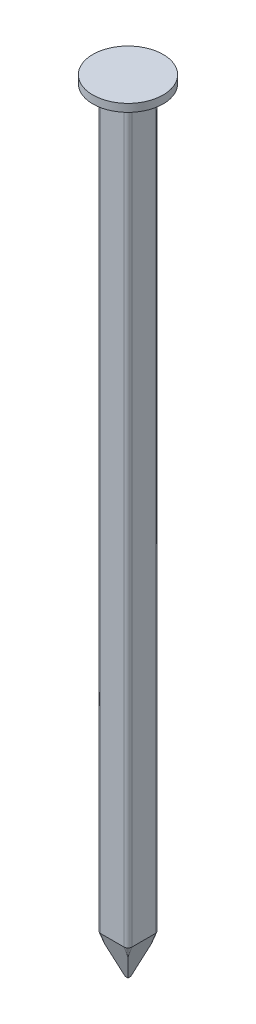
ISO-10303-21;
HEADER;
FILE_DESCRIPTION(('STEP AP214'),'2;1');
FILE_NAME('part.step','',(''),(''),'','','');
FILE_SCHEMA(('AUTOMOTIVE_DESIGN { 1 0 10303 214 1 1 1 1 }'));
ENDSEC;
DATA;
#1=APPLICATION_CONTEXT('core data for automotive mechanical design processes');
#2=APPLICATION_PROTOCOL_DEFINITION('international standard','automotive_design',2000,#1);
#3=PRODUCT_CONTEXT('',#1,'mechanical');
#4=PRODUCT('Part','Part','',(#3));
#5=PRODUCT_RELATED_PRODUCT_CATEGORY('part','',(#4));
#6=PRODUCT_DEFINITION_FORMATION('','',#4);
#7=PRODUCT_DEFINITION_CONTEXT('part definition',#1,'design');
#8=PRODUCT_DEFINITION('design','',#6,#7);
#9=PRODUCT_DEFINITION_SHAPE('','',#8);
#10=(LENGTH_UNIT() NAMED_UNIT(*) SI_UNIT(.MILLI.,.METRE.));
#11=(NAMED_UNIT(*) PLANE_ANGLE_UNIT() SI_UNIT($,.RADIAN.));
#12=(NAMED_UNIT(*) SI_UNIT($,.STERADIAN.) SOLID_ANGLE_UNIT());
#13=UNCERTAINTY_MEASURE_WITH_UNIT(LENGTH_MEASURE(1.E-05),#10,'distance_accuracy_value','');
#14=(GEOMETRIC_REPRESENTATION_CONTEXT(3) GLOBAL_UNCERTAINTY_ASSIGNED_CONTEXT((#13)) GLOBAL_UNIT_ASSIGNED_CONTEXT((#10,
#11,#12)) REPRESENTATION_CONTEXT('',''));
#15=CARTESIAN_POINT('',(0.,0.,0.));
#16=DIRECTION('',(0.,0.,1.));
#17=DIRECTION('',(1.,0.,0.));
#18=AXIS2_PLACEMENT_3D('',#15,#16,#17);
#19=CARTESIAN_POINT('',(-1.5,-95.,-1.5));
#20=DIRECTION('',(0.,1.,0.));
#21=DIRECTION('',(0.,0.,1.));
#22=AXIS2_PLACEMENT_3D('',#19,#20,#21);
#23=CYLINDRICAL_SURFACE('',#22,0.5);
#24=DIRECTION('',(0.,1.,0.));
#25=VECTOR('',#24,1.);
#26=CARTESIAN_POINT('',(-2.,-95.,-1.5));
#27=LINE('',#26,#25);
#28=CARTESIAN_POINT('',(-2.,-95.,-1.5));
#29=VERTEX_POINT('',#28);
#30=CARTESIAN_POINT('',(-2.,-2.15470053837925,-1.5));
#31=VERTEX_POINT('',#30);
#32=EDGE_CURVE('E37',#29,#31,#27,.T.);
#33=ORIENTED_EDGE('',*,*,#32,.T.);
#34=CARTESIAN_POINT('',(-1.99999996,-2.15476983593147,-1.4998));
#35=CARTESIAN_POINT('',(-2.00003684014058,-2.14575618471847,-1.525783701334));
#36=CARTESIAN_POINT('',(-1.99799540762178,-2.13744964998378,-1.55204559931092));
#37=CARTESIAN_POINT('',(-1.98968885677274,-2.1224428889359,-1.60441452090182));
#38=CARTESIAN_POINT('',(-1.98341509120903,-2.11574598939564,-1.63052111682859));
#39=CARTESIAN_POINT('',(-1.96655431052977,-2.10417422989742,-1.68182187885693));
#40=CARTESIAN_POINT('',(-1.95595614217757,-2.0993041443578,-1.70701350076372));
#41=CARTESIAN_POINT('',(-1.93063714242362,-2.0915829700223,-1.7555363353753));
#42=CARTESIAN_POINT('',(-1.91592151459877,-2.08872934879656,-1.77886984882169));
#43=CARTESIAN_POINT('',(-1.88358830025173,-2.08522815054813,-1.82178474147054));
#44=CARTESIAN_POINT('',(-1.86615388424268,-2.08447684250158,-1.84149580755948));
#45=CARTESIAN_POINT('',(-1.82842003165084,-2.08490769013287,-1.87792554006889));
#46=CARTESIAN_POINT('',(-1.80812092834765,-2.08608962106558,-1.89464455407418));
#47=CARTESIAN_POINT('',(-1.76588473919362,-2.09028666079645,-1.9242070774973));
#48=CARTESIAN_POINT('',(-1.74400805445983,-2.09325045964667,-1.93714452533199));
#49=CARTESIAN_POINT('',(-1.69877629962379,-2.10087626098998,-1.95948361219108));
#50=CARTESIAN_POINT('',(-1.67542001374561,-2.10553967539711,-1.96888229823954));
#51=CARTESIAN_POINT('',(-1.62674800369761,-2.11669609986594,-1.98437309599953));
#52=CARTESIAN_POINT('',(-1.60139225805675,-2.12326719153514,-1.99028176251223));
#53=CARTESIAN_POINT('',(-1.55053657305396,-2.13792801623413,-1.99810966579598));
#54=CARTESIAN_POINT('',(-1.52503686111886,-2.14601578498056,-2.0000340243494));
#55=CARTESIAN_POINT('',(-1.4998,-2.15476983593147,-1.99999996));
#56=B_SPLINE_CURVE_WITH_KNOTS('',3,(#34,#35,#36,#37,#38,#39,#40,#41,#42,#43,#44,#45,#46,#47,#48,
#49,#50,#51,#52,#53,#54,#55),.UNSPECIFIED.,.F.,.F.,(4,2,2,2,2,2,2,2,2,2,4),(0.,
0.0824667533171372,0.165102509809409,0.247952756315008,0.330698767336507,0.409283218051729,
0.487858533725675,0.564272874172714,0.640750839197006,0.720955531812514,0.801057058036558),.UNSPECIFIED.);
#57=CARTESIAN_POINT('',(-1.5,-2.15470053837925,-2.));
#58=VERTEX_POINT('',#57);
#59=EDGE_CURVE('E50',#31,#58,#56,.T.);
#60=ORIENTED_EDGE('',*,*,#59,.T.);
#61=DIRECTION('',(0.,1.,0.));
#62=VECTOR('',#61,1.);
#63=CARTESIAN_POINT('',(-1.5,-95.,-2.));
#64=LINE('',#63,#62);
#65=CARTESIAN_POINT('',(-1.5,-95.,-2.));
#66=VERTEX_POINT('',#65);
#67=EDGE_CURVE('E11',#66,#58,#64,.T.);
#68=ORIENTED_EDGE('',*,*,#67,.F.);
#69=CARTESIAN_POINT('',(-1.5,-95.,-1.5));
#70=DIRECTION('',(0.,1.,0.));
#71=DIRECTION('',(0.,0.,1.));
#72=AXIS2_PLACEMENT_3D('',#69,#70,#71);
#73=CIRCLE('',#72,0.5);
#74=EDGE_CURVE('E139',#66,#29,#73,.T.);
#75=ORIENTED_EDGE('',*,*,#74,.T.);
#76=EDGE_LOOP('',(#33,#60,#68,#75));
#77=FACE_BOUND('',#76,.T.);
#78=ADVANCED_FACE('F33',(#77),#23,.T.);
#79=CARTESIAN_POINT('',(-1.5,-95.,-2.));
#80=DIRECTION('',(0.,0.,-1.));
#81=DIRECTION('',(-1.,0.,0.));
#82=AXIS2_PLACEMENT_3D('',#79,#80,#81);
#83=PLANE('',#82);
#84=ORIENTED_EDGE('',*,*,#67,.T.);
#85=CARTESIAN_POINT('',(-3.28477697833419,-1.37773391061121,-2.));
#86=CARTESIAN_POINT('',(-3.1957489554578,-1.42162615000085,-2.));
#87=CARTESIAN_POINT('',(-3.1065352416587,-1.4651473830419,-2.));
#88=CARTESIAN_POINT('',(-2.92763830688956,-1.55124227115972,-2.));
#89=CARTESIAN_POINT('',(-2.8379550279747,-1.59381580571476,-2.));
#90=CARTESIAN_POINT('',(-2.65764119106146,-1.67798623291829,-2.));
#91=CARTESIAN_POINT('',(-2.56700819065231,-1.71957790907827,-2.));
#92=CARTESIAN_POINT('',(-2.3850827442105,-1.8012874669202,-2.));
#93=CARTESIAN_POINT('',(-2.29379032491544,-1.84140540796105,-2.));
#94=CARTESIAN_POINT('',(-2.10678906994039,-1.92132826897922,-2.));
#95=CARTESIAN_POINT('',(-2.01104810592664,-1.96105837882354,-2.));
#96=CARTESIAN_POINT('',(-1.8185319980613,-2.0379242656392,-2.));
#97=CARTESIAN_POINT('',(-1.72175693185083,-2.0750602358242,-2.));
#98=CARTESIAN_POINT('',(-1.5271219449094,-2.14590513694263,-2.));
#99=CARTESIAN_POINT('',(-1.42926397122525,-2.17961936938412,-2.));
#100=CARTESIAN_POINT('',(-1.23215592049787,-2.24265755514095,-2.));
#101=CARTESIAN_POINT('',(-1.13290623457587,-2.27198271593115,-2.));
#102=CARTESIAN_POINT('',(-0.933597053993751,-2.32478289951834,-2.));
#103=CARTESIAN_POINT('',(-0.833548434895385,-2.34829827972771,-2.));
#104=CARTESIAN_POINT('',(-0.632040787543292,-2.38831815959652,-2.));
#105=CARTESIAN_POINT('',(-0.530581961535164,-2.40482365408402,-2.));
#106=CARTESIAN_POINT('',(-0.328079247272528,-2.42931716075328,-2.));
#107=CARTESIAN_POINT('',(-0.227050020666948,-2.43742310448378,-2.));
#108=CARTESIAN_POINT('',(-0.0246603585570567,-2.4447602810518,-2.));
#109=CARTESIAN_POINT('',(0.07670007969145,-2.44399144017154,-2.));
#110=CARTESIAN_POINT('',(0.287373128420986,-2.43321875082972,-2.));
#111=CARTESIAN_POINT('',(0.39664614513125,-2.4224523080912,-2.));
#112=CARTESIAN_POINT('',(0.613874728342375,-2.39174346657701,-2.));
#113=CARTESIAN_POINT('',(0.721829986913001,-2.37179896369372,-2.));
#114=CARTESIAN_POINT('',(0.938211623678123,-2.32397126492567,-2.));
#115=CARTESIAN_POINT('',(1.04660380722846,-2.29593646846384,-2.));
#116=CARTESIAN_POINT('',(1.20786418144834,-2.24940143123157,-2.));
#117=CARTESIAN_POINT('',(1.26139841861617,-2.23314187827818,-2.));
#118=CARTESIAN_POINT('',(1.36805001858107,-2.19931741851383,-2.));
#119=CARTESIAN_POINT('',(1.42116740748875,-2.18175259419595,-2.));
#120=CARTESIAN_POINT('',(1.60797842683138,-2.1177680482363,-2.));
#121=CARTESIAN_POINT('',(1.74063256902876,-2.06831134429003,-2.));
#122=CARTESIAN_POINT('',(2.00397950927888,-1.96439782633082,-2.));
#123=CARTESIAN_POINT('',(2.13467164233102,-1.90993935964097,-2.));
#124=CARTESIAN_POINT('',(2.39465874617247,-1.7974294270013,-2.));
#125=CARTESIAN_POINT('',(2.52395206134399,-1.73937415604916,-2.));
#126=CARTESIAN_POINT('',(2.78133755448349,-1.62071700955447,-2.));
#127=CARTESIAN_POINT('',(2.90942988308771,-1.56011545875556,-2.));
#128=CARTESIAN_POINT('',(3.16520218523652,-1.43678485954758,-2.));
#129=CARTESIAN_POINT('',(3.29287857652262,-1.37404840548216,-2.));
#130=CARTESIAN_POINT('',(3.54751517855462,-1.2471363770796,-2.));
#131=CARTESIAN_POINT('',(3.67447537537265,-1.1829607748752,-2.));
#132=CARTESIAN_POINT('',(4.05436153839928,-0.988873159587793,-2.));
#133=CARTESIAN_POINT('',(4.30644994561204,-0.857323577105432,-2.));
#134=CARTESIAN_POINT('',(4.77602890920528,-0.609046776623574,-2.));
#135=CARTESIAN_POINT('',(4.99369703537458,-0.492653231139337,-2.));
#136=CARTESIAN_POINT('',(5.42829264550693,-0.25840108257643,-2.));
#137=CARTESIAN_POINT('',(5.6452199926524,-0.140542225737419,-2.));
#138=CARTESIAN_POINT('',(6.07693201068448,0.0953535484512582,-2.));
#139=CARTESIAN_POINT('',(6.29172079694644,0.213382948402986,-2.));
#140=CARTESIAN_POINT('',(6.72082497884446,0.450200576881975,-2.));
#141=CARTESIAN_POINT('',(6.9351404589103,0.568988652358618,-2.));
#142=CARTESIAN_POINT('',(7.14930467910168,0.688047032893749,-2.));
#143=B_SPLINE_CURVE_WITH_KNOTS('',3,(#85,#86,#87,#88,#89,#90,#91,#92,#93,#94,#95,#96,#97,#98,
#99,#100,#101,#102,#103,#104,#105,#106,#107,#108,#109,#110,#111,#112,#113,#114,#115,#116,#117,
#118,#119,#120,#121,#122,#123,#124,#125,#126,#127,#128,#129,#130,#131,#132,#133,#134,#135,#136,
#137,#138,#139,#140,#141,#142),.UNSPECIFIED.,.F.,.F.,(4,2,2,2,2,2,2,2,2,2,2,2,2,2,2,2,2,2,2,2,2,
2,2,2,2,2,2,2,4),(0.,0.297782400908863,0.595602457833325,0.894753823434955,1.19389312662066,
1.50483569396109,1.81575507729584,2.1261851344104,2.4365296316958,2.74465355992285,
3.05273374523402,3.35642726894603,3.6601233152688,3.98907232486469,4.31809678495671,
4.65373881487502,4.82157313735561,4.98939686172237,5.41394714545746,5.8386382167832,
6.26378649834016,6.68888072158565,7.1156405664752,7.54240868216504,8.39542107096749,
9.13591709001367,9.8765431844943,10.6117873881486,11.3468876793801),.UNSPECIFIED.);
#144=CARTESIAN_POINT('',(1.5,-2.15470053837925,-2.));
#145=VERTEX_POINT('',#144);
#146=EDGE_CURVE('E241',#58,#145,#143,.T.);
#147=ORIENTED_EDGE('',*,*,#146,.T.);
#148=DIRECTION('',(0.,1.,0.));
#149=VECTOR('',#148,1.);
#150=CARTESIAN_POINT('',(1.5,-95.,-2.));
#151=LINE('',#150,#149);
#152=CARTESIAN_POINT('',(1.5,-95.,-2.));
#153=VERTEX_POINT('',#152);
#154=EDGE_CURVE('E42',#153,#145,#151,.T.);
#155=ORIENTED_EDGE('',*,*,#154,.F.);
#156=DIRECTION('',(-1.,0.,0.));
#157=VECTOR('',#156,1.);
#158=CARTESIAN_POINT('',(-1.5,-95.,-2.));
#159=LINE('',#158,#157);
#160=EDGE_CURVE('E130',#153,#66,#159,.T.);
#161=ORIENTED_EDGE('',*,*,#160,.T.);
#162=EDGE_LOOP('',(#84,#147,#155,#161));
#163=FACE_BOUND('',#162,.T.);
#164=ADVANCED_FACE('F151',(#163),#83,.T.);
#165=CARTESIAN_POINT('',(1.5,-95.,-1.5));
#166=DIRECTION('',(0.,1.,0.));
#167=DIRECTION('',(0.,0.,1.));
#168=AXIS2_PLACEMENT_3D('',#165,#166,#167);
#169=CYLINDRICAL_SURFACE('',#168,0.5);
#170=ORIENTED_EDGE('',*,*,#154,.T.);
#171=CARTESIAN_POINT('',(1.4998,-2.15476983593147,-1.99999996));
#172=CARTESIAN_POINT('',(1.525783701334,-2.14575618471847,-2.00003684014058));
#173=CARTESIAN_POINT('',(1.55204559931092,-2.13744964998378,-1.99799540762178));
#174=CARTESIAN_POINT('',(1.60441452090182,-2.1224428889359,-1.98968885677274));
#175=CARTESIAN_POINT('',(1.63052111682859,-2.11574598939564,-1.98341509120903));
#176=CARTESIAN_POINT('',(1.68182187885693,-2.10417422989742,-1.96655431052977));
#177=CARTESIAN_POINT('',(1.70701350076372,-2.0993041443578,-1.95595614217757));
#178=CARTESIAN_POINT('',(1.7555363353753,-2.0915829700223,-1.93063714242362));
#179=CARTESIAN_POINT('',(1.77886984882169,-2.08872934879656,-1.91592151459877));
#180=CARTESIAN_POINT('',(1.82178474147054,-2.08522815054813,-1.88358830025173));
#181=CARTESIAN_POINT('',(1.84149580755948,-2.08447684250158,-1.86615388424268));
#182=CARTESIAN_POINT('',(1.87792554006889,-2.08490769013287,-1.82842003165084));
#183=CARTESIAN_POINT('',(1.89464455407418,-2.08608962106558,-1.80812092834765));
#184=CARTESIAN_POINT('',(1.9242070774973,-2.09028666079645,-1.76588473919362));
#185=CARTESIAN_POINT('',(1.93714452533199,-2.09325045964667,-1.74400805445983));
#186=CARTESIAN_POINT('',(1.95948361219108,-2.10087626098998,-1.69877629962379));
#187=CARTESIAN_POINT('',(1.96888229823954,-2.10553967539711,-1.67542001374561));
#188=CARTESIAN_POINT('',(1.98437309599953,-2.11669609986594,-1.62674800369761));
#189=CARTESIAN_POINT('',(1.99028176251223,-2.12326719153514,-1.60139225805675));
#190=CARTESIAN_POINT('',(1.99810966579598,-2.13792801623413,-1.55053657305396));
#191=CARTESIAN_POINT('',(2.00003402434941,-2.14601578498056,-1.52503686111886));
#192=CARTESIAN_POINT('',(1.99999996,-2.15476983593147,-1.4998));
#193=B_SPLINE_CURVE_WITH_KNOTS('',3,(#171,#172,#173,#174,#175,#176,#177,#178,#179,#180,#181,
#182,#183,#184,#185,#186,#187,#188,#189,#190,#191,#192),.UNSPECIFIED.,.F.,.F.,(4,2,2,2,2,2,2,2,
2,2,4),(0.,0.0824667533171368,0.165102509809409,0.247952756315008,0.330698767336507,
0.409283218051729,0.487858533725675,0.564272874172713,0.640750839197006,0.720955531812514,
0.801057058036559),.UNSPECIFIED.);
#194=CARTESIAN_POINT('',(2.,-2.15470053837925,-1.5));
#195=VERTEX_POINT('',#194);
#196=EDGE_CURVE('E235',#145,#195,#193,.T.);
#197=ORIENTED_EDGE('',*,*,#196,.T.);
#198=DIRECTION('',(0.,1.,0.));
#199=VECTOR('',#198,1.);
#200=CARTESIAN_POINT('',(2.,-95.,-1.5));
#201=LINE('',#200,#199);
#202=CARTESIAN_POINT('',(2.,-95.,-1.5));
#203=VERTEX_POINT('',#202);
#204=EDGE_CURVE('E162',#203,#195,#201,.T.);
#205=ORIENTED_EDGE('',*,*,#204,.F.);
#206=CARTESIAN_POINT('',(1.5,-95.,-1.5));
#207=DIRECTION('',(0.,1.,0.));
#208=DIRECTION('',(0.,0.,1.));
#209=AXIS2_PLACEMENT_3D('',#206,#207,#208);
#210=CIRCLE('',#209,0.5);
#211=EDGE_CURVE('E154',#203,#153,#210,.T.);
#212=ORIENTED_EDGE('',*,*,#211,.T.);
#213=EDGE_LOOP('',(#170,#197,#205,#212));
#214=FACE_BOUND('',#213,.T.);
#215=ADVANCED_FACE('F252',(#214),#169,.T.);
#216=CARTESIAN_POINT('',(2.,-95.,-1.5));
#217=DIRECTION('',(1.,0.,0.));
#218=DIRECTION('',(0.,0.,-1.));
#219=AXIS2_PLACEMENT_3D('',#216,#217,#218);
#220=PLANE('',#219);
#221=ORIENTED_EDGE('',*,*,#204,.T.);
#222=CARTESIAN_POINT('',(2.,-1.3777339106112,-3.28477697833419));
#223=CARTESIAN_POINT('',(2.,-1.42162615000085,-3.1957489554578));
#224=CARTESIAN_POINT('',(2.,-1.4651473830419,-3.1065352416587));
#225=CARTESIAN_POINT('',(2.,-1.55124227115972,-2.92763830688957));
#226=CARTESIAN_POINT('',(2.,-1.59381580571476,-2.8379550279747));
#227=CARTESIAN_POINT('',(2.,-1.67798623291829,-2.65764119106146));
#228=CARTESIAN_POINT('',(2.,-1.71957790907827,-2.56700819065231));
#229=CARTESIAN_POINT('',(2.,-1.8012874669202,-2.3850827442105));
#230=CARTESIAN_POINT('',(2.,-1.84140540796104,-2.29379032491544));
#231=CARTESIAN_POINT('',(2.,-1.92132826897921,-2.1067890699404));
#232=CARTESIAN_POINT('',(2.,-1.96105837882354,-2.01104810592664));
#233=CARTESIAN_POINT('',(2.,-2.0379242656392,-1.8185319980613));
#234=CARTESIAN_POINT('',(2.,-2.07506023582419,-1.72175693185083));
#235=CARTESIAN_POINT('',(2.,-2.14590513694262,-1.5271219449094));
#236=CARTESIAN_POINT('',(2.,-2.17961936938412,-1.42926397122525));
#237=CARTESIAN_POINT('',(2.,-2.24265755514095,-1.23215592049787));
#238=CARTESIAN_POINT('',(2.,-2.27198271593115,-1.13290623457587));
#239=CARTESIAN_POINT('',(2.,-2.32478289951833,-0.933597053993751));
#240=CARTESIAN_POINT('',(2.,-2.34829827972771,-0.833548434895385));
#241=CARTESIAN_POINT('',(2.,-2.38831815959652,-0.632040787543292));
#242=CARTESIAN_POINT('',(2.,-2.40482365408402,-0.530581961535164));
#243=CARTESIAN_POINT('',(2.,-2.42931716075328,-0.328079247272528));
#244=CARTESIAN_POINT('',(2.,-2.43742310448378,-0.227050020666948));
#245=CARTESIAN_POINT('',(2.,-2.4447602810518,-0.0246603585570567));
#246=CARTESIAN_POINT('',(2.,-2.44399144017154,0.0767000796914502));
#247=CARTESIAN_POINT('',(2.,-2.43321875082972,0.287373128420987));
#248=CARTESIAN_POINT('',(2.,-2.4224523080912,0.39664614513125));
#249=CARTESIAN_POINT('',(2.,-2.39174346657701,0.613874728342375));
#250=CARTESIAN_POINT('',(2.,-2.37179896369372,0.721829986913001));
#251=CARTESIAN_POINT('',(2.,-2.32397126492567,0.938211623678123));
#252=CARTESIAN_POINT('',(2.,-2.29593646846384,1.04660380722846));
#253=CARTESIAN_POINT('',(2.,-2.24940143123157,1.20786418144834));
#254=CARTESIAN_POINT('',(2.,-2.23314187827818,1.26139841861617));
#255=CARTESIAN_POINT('',(2.,-2.19931741851383,1.36805001858107));
#256=CARTESIAN_POINT('',(2.,-2.18175259419595,1.42116740748875));
#257=CARTESIAN_POINT('',(2.,-2.1177680482363,1.60797842683138));
#258=CARTESIAN_POINT('',(2.,-2.06831134429003,1.74063256902876));
#259=CARTESIAN_POINT('',(2.,-1.96439782633082,2.00397950927888));
#260=CARTESIAN_POINT('',(2.,-1.90993935964097,2.13467164233102));
#261=CARTESIAN_POINT('',(2.,-1.7974294270013,2.39465874617247));
#262=CARTESIAN_POINT('',(2.,-1.73937415604916,2.52395206134399));
#263=CARTESIAN_POINT('',(2.,-1.62071700955447,2.78133755448349));
#264=CARTESIAN_POINT('',(2.,-1.56011545875556,2.90942988308771));
#265=CARTESIAN_POINT('',(2.,-1.43678485954758,3.16520218523652));
#266=CARTESIAN_POINT('',(2.,-1.37404840548217,3.29287857652262));
#267=CARTESIAN_POINT('',(2.,-1.2471363770796,3.54751517855462));
#268=CARTESIAN_POINT('',(2.,-1.1829607748752,3.67447537537265));
#269=CARTESIAN_POINT('',(2.,-0.988873159587793,4.05436153839927));
#270=CARTESIAN_POINT('',(2.,-0.857323577105432,4.30644994561204));
#271=CARTESIAN_POINT('',(2.,-0.609046776623574,4.77602890920528));
#272=CARTESIAN_POINT('',(2.,-0.492653231139336,4.99369703537459));
#273=CARTESIAN_POINT('',(2.,-0.258401082576428,5.42829264550693));
#274=CARTESIAN_POINT('',(2.,-0.140542225737416,5.6452199926524));
#275=CARTESIAN_POINT('',(2.,0.0953535484512607,6.07693201068448));
#276=CARTESIAN_POINT('',(2.,0.213382948402989,6.29172079694644));
#277=CARTESIAN_POINT('',(2.,0.450200576881977,6.72082497884447));
#278=CARTESIAN_POINT('',(2.,0.56898865235862,6.9351404589103));
#279=CARTESIAN_POINT('',(2.,0.688047032893751,7.14930467910169));
#280=B_SPLINE_CURVE_WITH_KNOTS('',3,(#222,#223,#224,#225,#226,#227,#228,#229,#230,#231,#232,
#233,#234,#235,#236,#237,#238,#239,#240,#241,#242,#243,#244,#245,#246,#247,#248,#249,#250,#251,
#252,#253,#254,#255,#256,#257,#258,#259,#260,#261,#262,#263,#264,#265,#266,#267,#268,#269,#270,
#271,#272,#273,#274,#275,#276,#277,#278,#279),.UNSPECIFIED.,.F.,.F.,(4,2,2,2,2,2,2,2,2,2,2,2,2,
2,2,2,2,2,2,2,2,2,2,2,2,2,2,2,4),(0.,0.297782400908864,0.595602457833325,0.894753823434954,
1.19389312662066,1.50483569396109,1.81575507729584,2.1261851344104,2.4365296316958,
2.74465355992286,3.05273374523402,3.35642726894603,3.6601233152688,3.98907232486469,
4.31809678495671,4.65373881487502,4.82157313735561,4.98939686172237,5.41394714545746,
5.8386382167832,6.26378649834016,6.68888072158565,7.1156405664752,7.54240868216504,
8.39542107096749,9.13591709001367,9.8765431844943,10.6117873881486,11.3468876793801),.UNSPECIFIED.);
#281=CARTESIAN_POINT('',(2.,-2.15470053837925,1.5));
#282=VERTEX_POINT('',#281);
#283=EDGE_CURVE('E229',#195,#282,#280,.T.);
#284=ORIENTED_EDGE('',*,*,#283,.T.);
#285=DIRECTION('',(0.,1.,0.));
#286=VECTOR('',#285,1.);
#287=CARTESIAN_POINT('',(2.,-95.,1.5));
#288=LINE('',#287,#286);
#289=CARTESIAN_POINT('',(2.,-95.,1.5));
#290=VERTEX_POINT('',#289);
#291=EDGE_CURVE('E165',#290,#282,#288,.T.);
#292=ORIENTED_EDGE('',*,*,#291,.F.);
#293=DIRECTION('',(0.,0.,-1.));
#294=VECTOR('',#293,1.);
#295=CARTESIAN_POINT('',(2.,-95.,-1.5));
#296=LINE('',#295,#294);
#297=EDGE_CURVE('E157',#290,#203,#296,.T.);
#298=ORIENTED_EDGE('',*,*,#297,.T.);
#299=EDGE_LOOP('',(#221,#284,#292,#298));
#300=FACE_BOUND('',#299,.T.);
#301=ADVANCED_FACE('F255',(#300),#220,.T.);
#302=CARTESIAN_POINT('',(1.5,-95.,1.5));
#303=DIRECTION('',(0.,1.,0.));
#304=DIRECTION('',(0.,0.,1.));
#305=AXIS2_PLACEMENT_3D('',#302,#303,#304);
#306=CYLINDRICAL_SURFACE('',#305,0.5);
#307=ORIENTED_EDGE('',*,*,#291,.T.);
#308=CARTESIAN_POINT('',(1.99999996,-2.15476983593147,1.4998));
#309=CARTESIAN_POINT('',(2.00003684014058,-2.14575618471847,1.525783701334));
#310=CARTESIAN_POINT('',(1.99799540762178,-2.13744964998378,1.55204559931092));
#311=CARTESIAN_POINT('',(1.98968885677274,-2.1224428889359,1.60441452090182));
#312=CARTESIAN_POINT('',(1.98341509120903,-2.11574598939564,1.63052111682859));
#313=CARTESIAN_POINT('',(1.96655431052977,-2.10417422989742,1.68182187885693));
#314=CARTESIAN_POINT('',(1.95595614217757,-2.0993041443578,1.70701350076372));
#315=CARTESIAN_POINT('',(1.93063714242362,-2.0915829700223,1.7555363353753));
#316=CARTESIAN_POINT('',(1.91592151459877,-2.08872934879656,1.77886984882169));
#317=CARTESIAN_POINT('',(1.88358830025173,-2.08522815054813,1.82178474147054));
#318=CARTESIAN_POINT('',(1.86615388424268,-2.08447684250158,1.84149580755948));
#319=CARTESIAN_POINT('',(1.82842003165084,-2.08490769013287,1.87792554006889));
#320=CARTESIAN_POINT('',(1.80812092834765,-2.08608962106558,1.89464455407418));
#321=CARTESIAN_POINT('',(1.76588473919362,-2.09028666079645,1.9242070774973));
#322=CARTESIAN_POINT('',(1.74400805445983,-2.09325045964667,1.93714452533199));
#323=CARTESIAN_POINT('',(1.69877629962379,-2.10087626098998,1.95948361219108));
#324=CARTESIAN_POINT('',(1.67542001374561,-2.10553967539711,1.96888229823954));
#325=CARTESIAN_POINT('',(1.62674800369761,-2.11669609986594,1.98437309599953));
#326=CARTESIAN_POINT('',(1.60139225805675,-2.12326719153514,1.99028176251223));
#327=CARTESIAN_POINT('',(1.55053657305396,-2.13792801623413,1.99810966579598));
#328=CARTESIAN_POINT('',(1.52503686111886,-2.14601578498056,2.00003402434941));
#329=CARTESIAN_POINT('',(1.4998,-2.15476983593147,1.99999996));
#330=B_SPLINE_CURVE_WITH_KNOTS('',3,(#308,#309,#310,#311,#312,#313,#314,#315,#316,#317,#318,
#319,#320,#321,#322,#323,#324,#325,#326,#327,#328,#329),.UNSPECIFIED.,.F.,.F.,(4,2,2,2,2,2,2,2,
2,2,4),(0.,0.0824667533171372,0.16510250980941,0.247952756315008,0.330698767336508,
0.40928321805173,0.487858533725676,0.564272874172714,0.640750839197006,0.720955531812514,
0.801057058036559),.UNSPECIFIED.);
#331=CARTESIAN_POINT('',(1.5,-2.15470053837925,2.));
#332=VERTEX_POINT('',#331);
#333=EDGE_CURVE('E188',#282,#332,#330,.T.);
#334=ORIENTED_EDGE('',*,*,#333,.T.);
#335=DIRECTION('',(0.,1.,0.));
#336=VECTOR('',#335,1.);
#337=CARTESIAN_POINT('',(1.5,-95.,2.));
#338=LINE('',#337,#336);
#339=CARTESIAN_POINT('',(1.5,-95.,2.));
#340=VERTEX_POINT('',#339);
#341=EDGE_CURVE('E168',#340,#332,#338,.T.);
#342=ORIENTED_EDGE('',*,*,#341,.F.);
#343=CARTESIAN_POINT('',(1.5,-95.,1.5));
#344=DIRECTION('',(0.,1.,0.));
#345=DIRECTION('',(0.,0.,1.));
#346=AXIS2_PLACEMENT_3D('',#343,#344,#345);
#347=CIRCLE('',#346,0.5);
#348=EDGE_CURVE('E439',#340,#290,#347,.T.);
#349=ORIENTED_EDGE('',*,*,#348,.T.);
#350=EDGE_LOOP('',(#307,#334,#342,#349));
#351=FACE_BOUND('',#350,.T.);
#352=ADVANCED_FACE('F259',(#351),#306,.T.);
#353=CARTESIAN_POINT('',(-1.5,-95.,2.));
#354=DIRECTION('',(0.,0.,1.));
#355=DIRECTION('',(1.,0.,0.));
#356=AXIS2_PLACEMENT_3D('',#353,#354,#355);
#357=PLANE('',#356);
#358=ORIENTED_EDGE('',*,*,#341,.T.);
#359=CARTESIAN_POINT('',(-3.2847769699001,-1.37773391477034,2.));
#360=CARTESIAN_POINT('',(-3.19574894730758,-1.42162615398956,2.));
#361=CARTESIAN_POINT('',(-3.10653523379254,-1.4651473868603,2.));
#362=CARTESIAN_POINT('',(-2.92763829959231,-1.55124227463827,2.));
#363=CARTESIAN_POINT('',(-2.83795502096228,-1.59381580902379,2.));
#364=CARTESIAN_POINT('',(-2.65764118462238,-1.67798623588834,2.));
#365=CARTESIAN_POINT('',(-2.56700818450174,-1.71957791187888,2.));
#366=CARTESIAN_POINT('',(-2.3850827386387,-1.8012874693845,2.));
#367=CARTESIAN_POINT('',(-2.2937903196339,-1.84140541025846,2.));
#368=CARTESIAN_POINT('',(-2.10678906527064,-1.92132827093329,2.));
#369=CARTESIAN_POINT('',(-2.01104810157868,-1.96105838060168,2.));
#370=CARTESIAN_POINT('',(-1.81853199436155,-2.03792426707425,2.));
#371=CARTESIAN_POINT('',(-1.72175692847749,-2.07506023709207,2.));
#372=CARTESIAN_POINT('',(-1.52712194219479,-2.14590513789074,2.));
#373=CARTESIAN_POINT('',(-1.42926396884294,-2.17961937017961,2.));
#374=CARTESIAN_POINT('',(-1.23215591878883,-2.24265755565395,2.));
#375=CARTESIAN_POINT('',(-1.13290623320779,-2.27198271631427,2.));
#376=CARTESIAN_POINT('',(-0.93359705346489,-2.32478289963792,2.));
#377=CARTESIAN_POINT('',(-0.833548434866953,-2.34829827972175,2.));
#378=CARTESIAN_POINT('',(-0.632040788529265,-2.38831815941228,2.));
#379=CARTESIAN_POINT('',(-0.530581963035103,-2.40482365384698,2.));
#380=CARTESIAN_POINT('',(-0.328079249793761,-2.42931716050304,2.));
#381=CARTESIAN_POINT('',(-0.227050023695349,-2.43742310427133,2.));
#382=CARTESIAN_POINT('',(-0.0246603625943322,-2.44476028100805,2.));
#383=CARTESIAN_POINT('',(0.0767000751524665,-2.4439914402587,2.));
#384=CARTESIAN_POINT('',(0.287373123667501,-2.43321875122977,2.));
#385=CARTESIAN_POINT('',(0.396646140662543,-2.42245230860346,2.));
#386=CARTESIAN_POINT('',(0.613874724444266,-2.39174346724794,2.));
#387=CARTESIAN_POINT('',(0.721829983300703,-2.37179896441105,2.));
#388=CARTESIAN_POINT('',(0.938211620640256,-2.32397126568006,2.));
#389=CARTESIAN_POINT('',(1.04660380447901,-2.29593646920749,2.));
#390=CARTESIAN_POINT('',(1.20786417912403,-2.24940143192715,2.));
#391=CARTESIAN_POINT('',(1.26139841643239,-2.23314187895238,2.));
#392=CARTESIAN_POINT('',(1.368050016676,-2.19931741913637,2.));
#393=CARTESIAN_POINT('',(1.42116740572185,-2.1817525947882,2.));
#394=CARTESIAN_POINT('',(1.60797842495575,-2.11776804891162,2.));
#395=CARTESIAN_POINT('',(1.74063256691107,-2.06831134509073,2.));
#396=CARTESIAN_POINT('',(2.00397950668162,-1.96439782739051,2.));
#397=CARTESIAN_POINT('',(2.13467163949626,-1.90993936083429,2.));
#398=CARTESIAN_POINT('',(2.394658742865,-1.79742942846604,2.));
#399=CARTESIAN_POINT('',(2.52395205780133,-1.7393741576517,2.));
#400=CARTESIAN_POINT('',(2.78133755047196,-1.62071701143442,2.));
#401=CARTESIAN_POINT('',(2.9094298788425,-1.56011546077509,2.));
#402=CARTESIAN_POINT('',(3.16520218052375,-1.43678486184758,2.));
#403=CARTESIAN_POINT('',(3.29287857157597,-1.37404840792304,2.));
#404=CARTESIAN_POINT('',(3.54751517314058,-1.24713637980241,2.));
#405=CARTESIAN_POINT('',(3.67447536972509,-1.18296077773906,2.));
#406=CARTESIAN_POINT('',(4.05436153205172,-0.988873162874406,2.));
#407=CARTESIAN_POINT('',(4.30644993879819,-0.857323580673553,2.));
#408=CARTESIAN_POINT('',(4.7760289015448,-0.609046780703358,2.));
#409=CARTESIAN_POINT('',(4.99369702733367,-0.492653235449196,2.));
#410=CARTESIAN_POINT('',(5.42829263670458,-0.258401087345314,2.));
#411=CARTESIAN_POINT('',(5.64521998346905,-0.140542230735254,2.));
#412=CARTESIAN_POINT('',(6.07693200074013,0.0953535429974609,2.));
#413=CARTESIAN_POINT('',(6.29172078662211,0.213382942722164,2.));
#414=CARTESIAN_POINT('',(6.72082496775988,0.45020057074796,2.));
#415=CARTESIAN_POINT('',(6.93514044744544,0.568988645998434,2.));
#416=CARTESIAN_POINT('',(7.14930466725639,0.688047026307718,2.));
#417=B_SPLINE_CURVE_WITH_KNOTS('',3,(#359,#360,#361,#362,#363,#364,#365,#366,#367,#368,#369,
#370,#371,#372,#373,#374,#375,#376,#377,#378,#379,#380,#381,#382,#383,#384,#385,#386,#387,#388,
#389,#390,#391,#392,#393,#394,#395,#396,#397,#398,#399,#400,#401,#402,#403,#404,#405,#406,#407,
#408,#409,#410,#411,#412,#413,#414,#415,#416),.UNSPECIFIED.,.F.,.F.,(4,2,2,2,2,2,2,2,2,2,2,2,2,
2,2,2,2,2,2,2,2,2,2,2,2,2,2,2,4),(0.,0.297782399918932,0.595602455853339,0.8947538204563,
1.19389312264341,1.50483568888997,1.81575507113101,2.12618512715437,2.43652962334936,
2.74465355003172,3.05273373380049,3.35642725601095,3.66012330083192,3.98907231123957,
4.31809677214572,4.65373880290695,4.82157312580947,4.98939685059813,5.41394713352185,
5.83863820403574,6.26378648477969,6.68888070721238,7.1156405512858,7.54240866615953,
8.39542105333101,9.13591707104528,9.87654316419363,10.6117873665209,11.3468876564257),.UNSPECIFIED.);
#418=CARTESIAN_POINT('',(-1.5,-2.15470053837925,2.));
#419=VERTEX_POINT('',#418);
#420=EDGE_CURVE('E186',#332,#419,#417,.F.);
#421=ORIENTED_EDGE('',*,*,#420,.T.);
#422=DIRECTION('',(0.,1.,0.));
#423=VECTOR('',#422,1.);
#424=CARTESIAN_POINT('',(-1.5,-95.,2.));
#425=LINE('',#424,#423);
#426=CARTESIAN_POINT('',(-1.5,-95.,2.));
#427=VERTEX_POINT('',#426);
#428=EDGE_CURVE('E171',#427,#419,#425,.T.);
#429=ORIENTED_EDGE('',*,*,#428,.F.);
#430=DIRECTION('',(1.,0.,0.));
#431=VECTOR('',#430,1.);
#432=CARTESIAN_POINT('',(-1.5,-95.,2.));
#433=LINE('',#432,#431);
#434=EDGE_CURVE('E441',#427,#340,#433,.T.);
#435=ORIENTED_EDGE('',*,*,#434,.T.);
#436=EDGE_LOOP('',(#358,#421,#429,#435));
#437=FACE_BOUND('',#436,.T.);
#438=ADVANCED_FACE('F263',(#437),#357,.T.);
#439=CARTESIAN_POINT('',(-1.5,-95.,1.5));
#440=DIRECTION('',(0.,1.,0.));
#441=DIRECTION('',(0.,0.,1.));
#442=AXIS2_PLACEMENT_3D('',#439,#440,#441);
#443=CYLINDRICAL_SURFACE('',#442,0.5);
#444=ORIENTED_EDGE('',*,*,#428,.T.);
#445=CARTESIAN_POINT('',(-1.4998,-2.15476983593147,1.99999996));
#446=CARTESIAN_POINT('',(-1.525783701334,-2.14575618471847,2.00003684014058));
#447=CARTESIAN_POINT('',(-1.55204559931092,-2.13744964998378,1.99799540762178));
#448=CARTESIAN_POINT('',(-1.60441452090182,-2.1224428889359,1.98968885677274));
#449=CARTESIAN_POINT('',(-1.63052111682859,-2.11574598939564,1.98341509120903));
#450=CARTESIAN_POINT('',(-1.68182187885693,-2.10417422989742,1.96655431052977));
#451=CARTESIAN_POINT('',(-1.70701350076372,-2.09930414435781,1.95595614217757));
#452=CARTESIAN_POINT('',(-1.7555363353753,-2.0915829700223,1.93063714242362));
#453=CARTESIAN_POINT('',(-1.77886984882169,-2.08872934879656,1.91592151459877));
#454=CARTESIAN_POINT('',(-1.82178474147054,-2.08522815054813,1.88358830025173));
#455=CARTESIAN_POINT('',(-1.84149580755948,-2.08447684250158,1.86615388424268));
#456=CARTESIAN_POINT('',(-1.87792554006888,-2.08490769013287,1.82842003165084));
#457=CARTESIAN_POINT('',(-1.89464455407418,-2.08608962106558,1.80812092834765));
#458=CARTESIAN_POINT('',(-1.9242070774973,-2.09028666079645,1.76588473919362));
#459=CARTESIAN_POINT('',(-1.93714452533199,-2.09325045964667,1.74400805445983));
#460=CARTESIAN_POINT('',(-1.95948361219107,-2.10087626098998,1.69877629962379));
#461=CARTESIAN_POINT('',(-1.96888229823954,-2.10553967539711,1.67542001374561));
#462=CARTESIAN_POINT('',(-1.98437309599953,-2.11669609986594,1.62674800369761));
#463=CARTESIAN_POINT('',(-1.99028176251223,-2.12326719153514,1.60139225805675));
#464=CARTESIAN_POINT('',(-1.99810966579598,-2.13792801623413,1.55053657305396));
#465=CARTESIAN_POINT('',(-2.0000340243494,-2.14601578498056,1.52503686111886));
#466=CARTESIAN_POINT('',(-1.99999996,-2.15476983593147,1.4998));
#467=B_SPLINE_CURVE_WITH_KNOTS('',3,(#445,#446,#447,#448,#449,#450,#451,#452,#453,#454,#455,
#456,#457,#458,#459,#460,#461,#462,#463,#464,#465,#466),.UNSPECIFIED.,.F.,.F.,(4,2,2,2,2,2,2,2,
2,2,4),(0.,0.0824667533171369,0.165102509809409,0.247952756315007,0.330698767336507,
0.409283218051729,0.487858533725674,0.564272874172713,0.640750839197006,0.720955531812513,
0.801057058036558),.UNSPECIFIED.);
#468=CARTESIAN_POINT('',(-2.,-2.15470053837925,1.5));
#469=VERTEX_POINT('',#468);
#470=EDGE_CURVE('E183',#419,#469,#467,.T.);
#471=ORIENTED_EDGE('',*,*,#470,.T.);
#472=DIRECTION('',(0.,1.,0.));
#473=VECTOR('',#472,1.);
#474=CARTESIAN_POINT('',(-2.,-95.,1.5));
#475=LINE('',#474,#473);
#476=CARTESIAN_POINT('',(-2.,-95.,1.5));
#477=VERTEX_POINT('',#476);
#478=EDGE_CURVE('E156',#477,#469,#475,.T.);
#479=ORIENTED_EDGE('',*,*,#478,.F.);
#480=CARTESIAN_POINT('',(-1.5,-95.,1.5));
#481=DIRECTION('',(0.,1.,0.));
#482=DIRECTION('',(0.,0.,1.));
#483=AXIS2_PLACEMENT_3D('',#480,#481,#482);
#484=CIRCLE('',#483,0.5);
#485=EDGE_CURVE('E58',#477,#427,#484,.T.);
#486=ORIENTED_EDGE('',*,*,#485,.T.);
#487=EDGE_LOOP('',(#444,#471,#479,#486));
#488=FACE_BOUND('',#487,.T.);
#489=ADVANCED_FACE('F182',(#488),#443,.T.);
#490=CARTESIAN_POINT('',(-2.,-95.,-1.5));
#491=DIRECTION('',(-1.,0.,0.));
#492=DIRECTION('',(0.,0.,1.));
#493=AXIS2_PLACEMENT_3D('',#490,#491,#492);
#494=PLANE('',#493);
#495=ORIENTED_EDGE('',*,*,#478,.T.);
#496=CARTESIAN_POINT('',(-2.,-1.37773391061121,-3.28477697833419));
#497=CARTESIAN_POINT('',(-2.,-1.42162615000085,-3.1957489554578));
#498=CARTESIAN_POINT('',(-2.,-1.4651473830419,-3.1065352416587));
#499=CARTESIAN_POINT('',(-2.,-1.55124227115972,-2.92763830688956));
#500=CARTESIAN_POINT('',(-2.,-1.59381580571476,-2.83795502797469));
#501=CARTESIAN_POINT('',(-2.,-1.67798623291829,-2.65764119106146));
#502=CARTESIAN_POINT('',(-2.,-1.71957790907827,-2.56700819065231));
#503=CARTESIAN_POINT('',(-2.,-1.8012874669202,-2.3850827442105));
#504=CARTESIAN_POINT('',(-2.,-1.84140540796105,-2.29379032491544));
#505=CARTESIAN_POINT('',(-2.,-1.92132826897922,-2.10678906994039));
#506=CARTESIAN_POINT('',(-2.,-1.96105837882354,-2.01104810592664));
#507=CARTESIAN_POINT('',(-2.,-2.0379242656392,-1.8185319980613));
#508=CARTESIAN_POINT('',(-2.,-2.0750602358242,-1.72175693185083));
#509=CARTESIAN_POINT('',(-2.,-2.14590513694263,-1.5271219449094));
#510=CARTESIAN_POINT('',(-2.,-2.17961936938412,-1.42926397122525));
#511=CARTESIAN_POINT('',(-2.,-2.24265755514095,-1.23215592049787));
#512=CARTESIAN_POINT('',(-2.,-2.27198271593115,-1.13290623457587));
#513=CARTESIAN_POINT('',(-2.,-2.32478289951834,-0.933597053993751));
#514=CARTESIAN_POINT('',(-2.,-2.34829827972771,-0.833548434895385));
#515=CARTESIAN_POINT('',(-2.,-2.38831815959652,-0.632040787543292));
#516=CARTESIAN_POINT('',(-2.,-2.40482365408402,-0.530581961535164));
#517=CARTESIAN_POINT('',(-2.,-2.42931716075328,-0.328079247272528));
#518=CARTESIAN_POINT('',(-2.,-2.43742310448378,-0.227050020666949));
#519=CARTESIAN_POINT('',(-2.,-2.4447602810518,-0.0246603585570572));
#520=CARTESIAN_POINT('',(-2.,-2.44399144017154,0.0767000796914496));
#521=CARTESIAN_POINT('',(-2.,-2.43321875082972,0.287373128420986));
#522=CARTESIAN_POINT('',(-2.,-2.4224523080912,0.396646145131249));
#523=CARTESIAN_POINT('',(-2.,-2.39174346657701,0.613874728342375));
#524=CARTESIAN_POINT('',(-2.,-2.37179896369372,0.721829986913001));
#525=CARTESIAN_POINT('',(-2.,-2.32397126492567,0.938211623678123));
#526=CARTESIAN_POINT('',(-2.,-2.29593646846384,1.04660380722846));
#527=CARTESIAN_POINT('',(-2.,-2.24940143123157,1.20786418144834));
#528=CARTESIAN_POINT('',(-2.,-2.23314187827818,1.26139841861617));
#529=CARTESIAN_POINT('',(-2.,-2.19931741851383,1.36805001858107));
#530=CARTESIAN_POINT('',(-2.,-2.18175259419595,1.42116740748875));
#531=CARTESIAN_POINT('',(-2.,-2.1177680482363,1.60797842683138));
#532=CARTESIAN_POINT('',(-2.,-2.06831134429003,1.74063256902876));
#533=CARTESIAN_POINT('',(-2.,-1.96439782633082,2.00397950927888));
#534=CARTESIAN_POINT('',(-2.,-1.90993935964097,2.13467164233102));
#535=CARTESIAN_POINT('',(-2.,-1.7974294270013,2.39465874617246));
#536=CARTESIAN_POINT('',(-2.,-1.73937415604916,2.52395206134399));
#537=CARTESIAN_POINT('',(-2.,-1.62071700955448,2.78133755448349));
#538=CARTESIAN_POINT('',(-2.,-1.56011545875556,2.90942988308771));
#539=CARTESIAN_POINT('',(-2.,-1.43678485954758,3.16520218523651));
#540=CARTESIAN_POINT('',(-2.,-1.37404840548217,3.29287857652262));
#541=CARTESIAN_POINT('',(-2.,-1.2471363770796,3.54751517855461));
#542=CARTESIAN_POINT('',(-2.,-1.1829607748752,3.67447537537264));
#543=CARTESIAN_POINT('',(-2.,-0.988873159587796,4.05436153839927));
#544=CARTESIAN_POINT('',(-2.,-0.857323577105435,4.30644994561203));
#545=CARTESIAN_POINT('',(-2.,-0.609046776623577,4.77602890920528));
#546=CARTESIAN_POINT('',(-2.,-0.49265323113934,4.99369703537458));
#547=CARTESIAN_POINT('',(-2.,-0.258401082576433,5.42829264550692));
#548=CARTESIAN_POINT('',(-2.,-0.14054222573742,5.6452199926524));
#549=CARTESIAN_POINT('',(-2.,0.0953535484512568,6.07693201068447));
#550=CARTESIAN_POINT('',(-2.,0.213382948402985,6.29172079694644));
#551=CARTESIAN_POINT('',(-2.,0.450200576881973,6.72082497884446));
#552=CARTESIAN_POINT('',(-2.,0.568988652358615,6.93514045891029));
#553=CARTESIAN_POINT('',(-2.,0.688047032893748,7.14930467910168));
#554=B_SPLINE_CURVE_WITH_KNOTS('',3,(#496,#497,#498,#499,#500,#501,#502,#503,#504,#505,#506,
#507,#508,#509,#510,#511,#512,#513,#514,#515,#516,#517,#518,#519,#520,#521,#522,#523,#524,#525,
#526,#527,#528,#529,#530,#531,#532,#533,#534,#535,#536,#537,#538,#539,#540,#541,#542,#543,#544,
#545,#546,#547,#548,#549,#550,#551,#552,#553),.UNSPECIFIED.,.F.,.F.,(4,2,2,2,2,2,2,2,2,2,2,2,2,
2,2,2,2,2,2,2,2,2,2,2,2,2,2,2,4),(0.,0.297782400908864,0.595602457833325,0.894753823434955,
1.19389312662066,1.50483569396109,1.81575507729584,2.1261851344104,2.4365296316958,
2.74465355992285,3.05273374523402,3.35642726894603,3.6601233152688,3.98907232486469,
4.31809678495671,4.65373881487502,4.82157313735561,4.98939686172237,5.41394714545745,
5.8386382167832,6.26378649834016,6.68888072158565,7.1156405664752,7.54240868216504,
8.39542107096748,9.13591709001366,9.87654318449429,10.6117873881486,11.3468876793801),.UNSPECIFIED.);
#555=EDGE_CURVE('E179',#469,#31,#554,.F.);
#556=ORIENTED_EDGE('',*,*,#555,.T.);
#557=ORIENTED_EDGE('',*,*,#32,.F.);
#558=DIRECTION('',(0.,0.,1.));
#559=VECTOR('',#558,1.);
#560=CARTESIAN_POINT('',(-2.,-95.,-1.5));
#561=LINE('',#560,#559);
#562=EDGE_CURVE('E146',#29,#477,#561,.T.);
#563=ORIENTED_EDGE('',*,*,#562,.T.);
#564=EDGE_LOOP('',(#495,#556,#557,#563));
#565=FACE_BOUND('',#564,.T.);
#566=ADVANCED_FACE('F177',(#565),#494,.T.);
#567=CARTESIAN_POINT('',(0.,-1.,0.));
#568=DIRECTION('',(0.,1.,0.));
#569=DIRECTION('',(0.,0.,-1.));
#570=AXIS2_PLACEMENT_3D('',#567,#568,#569);
#571=CONICAL_SURFACE('',#570,4.5,1.0471975511966);
#572=ORIENTED_EDGE('',*,*,#59,.F.);
#573=ORIENTED_EDGE('',*,*,#555,.F.);
#574=ORIENTED_EDGE('',*,*,#470,.F.);
#575=ORIENTED_EDGE('',*,*,#420,.F.);
#576=ORIENTED_EDGE('',*,*,#333,.F.);
#577=ORIENTED_EDGE('',*,*,#283,.F.);
#578=ORIENTED_EDGE('',*,*,#196,.F.);
#579=ORIENTED_EDGE('',*,*,#146,.F.);
#580=EDGE_LOOP('',(#572,#573,#574,#575,#576,#577,#578,#579));
#581=FACE_BOUND('',#580,.T.);
#582=CARTESIAN_POINT('',(0.,-1.,0.));
#583=DIRECTION('',(0.,-1.,0.));
#584=DIRECTION('',(0.,0.,-1.));
#585=AXIS2_PLACEMENT_3D('',#582,#583,#584);
#586=CIRCLE('',#585,4.5);
#587=CARTESIAN_POINT('',(0.,-1.,-4.5));
#588=VERTEX_POINT('',#587);
#589=EDGE_CURVE('E190',#588,#588,#586,.T.);
#590=ORIENTED_EDGE('',*,*,#589,.T.);
#591=EDGE_LOOP('',(#590));
#592=FACE_BOUND('',#591,.T.);
#593=ADVANCED_FACE('F207',(#581,#592),#571,.T.);
#594=CARTESIAN_POINT('',(-1.5,0.,-1.5));
#595=DIRECTION('',(0.,1.,0.));
#596=DIRECTION('',(0.,0.,1.));
#597=AXIS2_PLACEMENT_3D('',#594,#595,#596);
#598=PLANE('',#597);
#599=CARTESIAN_POINT('',(0.,0.,0.));
#600=DIRECTION('',(0.,1.,0.));
#601=DIRECTION('',(0.,0.,1.));
#602=AXIS2_PLACEMENT_3D('',#599,#600,#601);
#603=CIRCLE('',#602,4.5);
#604=CARTESIAN_POINT('',(0.,0.,4.5));
#605=VERTEX_POINT('',#604);
#606=EDGE_CURVE('E147',#605,#605,#603,.T.);
#607=ORIENTED_EDGE('',*,*,#606,.T.);
#608=EDGE_LOOP('',(#607));
#609=FACE_BOUND('',#608,.T.);
#610=ADVANCED_FACE('F212',(#609),#598,.T.);
#611=CARTESIAN_POINT('',(0.,-1.,0.));
#612=DIRECTION('',(0.,1.,0.));
#613=DIRECTION('',(0.,0.,1.));
#614=AXIS2_PLACEMENT_3D('',#611,#612,#613);
#615=CYLINDRICAL_SURFACE('',#614,4.5);
#616=ORIENTED_EDGE('',*,*,#589,.F.);
#617=EDGE_LOOP('',(#616));
#618=FACE_BOUND('',#617,.T.);
#619=ORIENTED_EDGE('',*,*,#606,.F.);
#620=EDGE_LOOP('',(#619));
#621=FACE_BOUND('',#620,.T.);
#622=ADVANCED_FACE('F214',(#618,#621),#615,.T.);
#623=CARTESIAN_POINT('',(-1.5,-95.,-1.5));
#624=DIRECTION('',(0.,1.,0.));
#625=DIRECTION('',(0.,0.,-1.));
#626=AXIS2_PLACEMENT_3D('',#623,#624,#625);
#627=CONICAL_SURFACE('',#626,0.5,0.349065850398867);
#628=DIRECTION('',(0.,0.939692620785908,-0.34202014332567));
#629=VECTOR('',#628,1.);
#630=CARTESIAN_POINT('',(-1.5,-95.,-2.));
#631=LINE('',#630,#629);
#632=CARTESIAN_POINT('',(-1.5,-96.3737387097273,-1.5));
#633=VERTEX_POINT('',#632);
#634=EDGE_CURVE('E125',#633,#66,#631,.T.);
#635=ORIENTED_EDGE('',*,*,#634,.F.);
#636=DIRECTION('',(-0.34202014332567,0.939692620785908,0.));
#637=VECTOR('',#636,1.);
#638=CARTESIAN_POINT('',(-2.,-95.,-1.5));
#639=LINE('',#638,#637);
#640=EDGE_CURVE('E142',#633,#29,#639,.T.);
#641=ORIENTED_EDGE('',*,*,#640,.T.);
#642=ORIENTED_EDGE('',*,*,#74,.F.);
#643=EDGE_LOOP('',(#635,#641,#642));
#644=FACE_BOUND('',#643,.T.);
#645=ADVANCED_FACE('F141',(#644),#627,.T.);
#646=CARTESIAN_POINT('',(-1.5,-95.,-2.));
#647=DIRECTION('',(0.,-0.34202014332567,-0.939692620785908));
#648=DIRECTION('',(0.,0.939692620785908,-0.34202014332567));
#649=AXIS2_PLACEMENT_3D('',#646,#647,#648);
#650=PLANE('',#649);
#651=ORIENTED_EDGE('',*,*,#160,.F.);
#652=DIRECTION('',(0.,0.939692620785908,-0.34202014332567));
#653=VECTOR('',#652,1.);
#654=CARTESIAN_POINT('',(1.5,-95.,-2.));
#655=LINE('',#654,#653);
#656=CARTESIAN_POINT('',(1.5,-96.3737387097273,-1.5));
#657=VERTEX_POINT('',#656);
#658=EDGE_CURVE('E136',#657,#153,#655,.T.);
#659=ORIENTED_EDGE('',*,*,#658,.F.);
#660=DIRECTION('',(0.323615577118185,0.889126490715988,-0.323615577118185));
#661=VECTOR('',#660,1.);
#662=CARTESIAN_POINT('',(1.94763647912323,-95.1438675912121,-1.94763647912323));
#663=LINE('',#662,#661);
#664=CARTESIAN_POINT('',(0.180148828668981,-100.,-0.180148828668981));
#665=VERTEX_POINT('',#664);
#666=EDGE_CURVE('E425',#665,#657,#663,.T.);
#667=ORIENTED_EDGE('',*,*,#666,.F.);
#668=DIRECTION('',(-1.,0.,0.));
#669=VECTOR('',#668,1.);
#670=CARTESIAN_POINT('',(-1.5,-100.,-0.180148828668981));
#671=LINE('',#670,#669);
#672=CARTESIAN_POINT('',(-0.180148828668981,-100.,-0.180148828668981));
#673=VERTEX_POINT('',#672);
#674=EDGE_CURVE('E403',#673,#665,#671,.F.);
#675=ORIENTED_EDGE('',*,*,#674,.F.);
#676=DIRECTION('',(-0.323615577118186,0.889126490715988,-0.323615577118185));
#677=VECTOR('',#676,1.);
#678=CARTESIAN_POINT('',(-1.94763647912323,-95.1438675912121,-1.94763647912323));
#679=LINE('',#678,#677);
#680=EDGE_CURVE('E133',#673,#633,#679,.T.);
#681=ORIENTED_EDGE('',*,*,#680,.T.);
#682=ORIENTED_EDGE('',*,*,#634,.T.);
#683=EDGE_LOOP('',(#651,#659,#667,#675,#681,#682));
#684=FACE_BOUND('',#683,.T.);
#685=ADVANCED_FACE('F127',(#684),#650,.T.);
#686=CARTESIAN_POINT('',(1.5,-95.,-1.5));
#687=DIRECTION('',(0.,1.,0.));
#688=DIRECTION('',(0.,0.,-1.));
#689=AXIS2_PLACEMENT_3D('',#686,#687,#688);
#690=CONICAL_SURFACE('',#689,0.5,0.349065850398867);
#691=DIRECTION('',(0.34202014332567,0.939692620785908,0.));
#692=VECTOR('',#691,1.);
#693=CARTESIAN_POINT('',(2.,-95.,-1.5));
#694=LINE('',#693,#692);
#695=EDGE_CURVE('E424',#657,#203,#694,.T.);
#696=ORIENTED_EDGE('',*,*,#695,.F.);
#697=ORIENTED_EDGE('',*,*,#658,.T.);
#698=ORIENTED_EDGE('',*,*,#211,.F.);
#699=EDGE_LOOP('',(#696,#697,#698));
#700=FACE_BOUND('',#699,.T.);
#701=ADVANCED_FACE('F328',(#700),#690,.T.);
#702=CARTESIAN_POINT('',(2.,-95.,-1.5));
#703=DIRECTION('',(0.939692620785908,-0.34202014332567,0.));
#704=DIRECTION('',(0.34202014332567,0.939692620785908,0.));
#705=AXIS2_PLACEMENT_3D('',#702,#703,#704);
#706=PLANE('',#705);
#707=ORIENTED_EDGE('',*,*,#297,.F.);
#708=DIRECTION('',(0.34202014332567,0.939692620785908,0.));
#709=VECTOR('',#708,1.);
#710=CARTESIAN_POINT('',(2.,-95.,1.5));
#711=LINE('',#710,#709);
#712=CARTESIAN_POINT('',(1.5,-96.3737387097273,1.5));
#713=VERTEX_POINT('',#712);
#714=EDGE_CURVE('E421',#713,#290,#711,.T.);
#715=ORIENTED_EDGE('',*,*,#714,.F.);
#716=DIRECTION('',(0.323615577118185,0.889126490715988,0.323615577118185));
#717=VECTOR('',#716,1.);
#718=CARTESIAN_POINT('',(1.94763647912323,-95.1438675912121,1.94763647912323));
#719=LINE('',#718,#717);
#720=CARTESIAN_POINT('',(0.180148828668981,-100.,0.180148828668981));
#721=VERTEX_POINT('',#720);
#722=EDGE_CURVE('E419',#721,#713,#719,.T.);
#723=ORIENTED_EDGE('',*,*,#722,.F.);
#724=DIRECTION('',(0.,0.,-1.));
#725=VECTOR('',#724,1.);
#726=CARTESIAN_POINT('',(0.180148828668981,-100.,-1.5));
#727=LINE('',#726,#725);
#728=EDGE_CURVE('E430',#665,#721,#727,.F.);
#729=ORIENTED_EDGE('',*,*,#728,.F.);
#730=ORIENTED_EDGE('',*,*,#666,.T.);
#731=ORIENTED_EDGE('',*,*,#695,.T.);
#732=EDGE_LOOP('',(#707,#715,#723,#729,#730,#731));
#733=FACE_BOUND('',#732,.T.);
#734=ADVANCED_FACE('F336',(#733),#706,.T.);
#735=CARTESIAN_POINT('',(1.5,-95.,1.5));
#736=DIRECTION('',(0.,1.,0.));
#737=DIRECTION('',(0.,0.,-1.));
#738=AXIS2_PLACEMENT_3D('',#735,#736,#737);
#739=CONICAL_SURFACE('',#738,0.5,0.349065850398867);
#740=DIRECTION('',(0.,0.939692620785908,0.34202014332567));
#741=VECTOR('',#740,1.);
#742=CARTESIAN_POINT('',(1.5,-95.,2.));
#743=LINE('',#742,#741);
#744=EDGE_CURVE('E418',#713,#340,#743,.T.);
#745=ORIENTED_EDGE('',*,*,#744,.F.);
#746=ORIENTED_EDGE('',*,*,#714,.T.);
#747=ORIENTED_EDGE('',*,*,#348,.F.);
#748=EDGE_LOOP('',(#745,#746,#747));
#749=FACE_BOUND('',#748,.T.);
#750=ADVANCED_FACE('F345',(#749),#739,.T.);
#751=CARTESIAN_POINT('',(1.5,-95.,2.));
#752=DIRECTION('',(0.,-0.34202014332567,0.939692620785908));
#753=DIRECTION('',(0.,-0.939692620785908,-0.34202014332567));
#754=AXIS2_PLACEMENT_3D('',#751,#752,#753);
#755=PLANE('',#754);
#756=ORIENTED_EDGE('',*,*,#434,.F.);
#757=DIRECTION('',(0.,0.939692620785908,0.34202014332567));
#758=VECTOR('',#757,1.);
#759=CARTESIAN_POINT('',(-1.5,-95.,2.));
#760=LINE('',#759,#758);
#761=CARTESIAN_POINT('',(-1.5,-96.3737387097273,1.5));
#762=VERTEX_POINT('',#761);
#763=EDGE_CURVE('E414',#762,#427,#760,.T.);
#764=ORIENTED_EDGE('',*,*,#763,.F.);
#765=DIRECTION('',(-0.323615577118185,0.889126490715988,0.323615577118185));
#766=VECTOR('',#765,1.);
#767=CARTESIAN_POINT('',(-1.94763647912323,-95.1438675912121,1.94763647912323));
#768=LINE('',#767,#766);
#769=CARTESIAN_POINT('',(-0.180148828668981,-100.,0.180148828668981));
#770=VERTEX_POINT('',#769);
#771=EDGE_CURVE('E412',#770,#762,#768,.T.);
#772=ORIENTED_EDGE('',*,*,#771,.F.);
#773=DIRECTION('',(1.,0.,0.));
#774=VECTOR('',#773,1.);
#775=CARTESIAN_POINT('',(1.5,-100.,0.180148828668981));
#776=LINE('',#775,#774);
#777=EDGE_CURVE('E405',#721,#770,#776,.F.);
#778=ORIENTED_EDGE('',*,*,#777,.F.);
#779=ORIENTED_EDGE('',*,*,#722,.T.);
#780=ORIENTED_EDGE('',*,*,#744,.T.);
#781=EDGE_LOOP('',(#756,#764,#772,#778,#779,#780));
#782=FACE_BOUND('',#781,.T.);
#783=ADVANCED_FACE('F355',(#782),#755,.T.);
#784=CARTESIAN_POINT('',(-1.5,-95.,1.5));
#785=DIRECTION('',(0.,1.,0.));
#786=DIRECTION('',(0.,0.,-1.));
#787=AXIS2_PLACEMENT_3D('',#784,#785,#786);
#788=CONICAL_SURFACE('',#787,0.5,0.349065850398867);
#789=DIRECTION('',(-0.34202014332567,0.939692620785908,0.));
#790=VECTOR('',#789,1.);
#791=CARTESIAN_POINT('',(-2.,-95.,1.5));
#792=LINE('',#791,#790);
#793=EDGE_CURVE('E415',#762,#477,#792,.T.);
#794=ORIENTED_EDGE('',*,*,#793,.F.);
#795=ORIENTED_EDGE('',*,*,#763,.T.);
#796=ORIENTED_EDGE('',*,*,#485,.F.);
#797=EDGE_LOOP('',(#794,#795,#796));
#798=FACE_BOUND('',#797,.T.);
#799=ADVANCED_FACE('F365',(#798),#788,.T.);
#800=CARTESIAN_POINT('',(-2.,-95.,1.5));
#801=DIRECTION('',(-0.939692620785908,-0.34202014332567,0.));
#802=DIRECTION('',(0.34202014332567,-0.939692620785908,0.));
#803=AXIS2_PLACEMENT_3D('',#800,#801,#802);
#804=PLANE('',#803);
#805=ORIENTED_EDGE('',*,*,#562,.F.);
#806=ORIENTED_EDGE('',*,*,#640,.F.);
#807=ORIENTED_EDGE('',*,*,#680,.F.);
#808=DIRECTION('',(0.,0.,1.));
#809=VECTOR('',#808,1.);
#810=CARTESIAN_POINT('',(-0.18014882866898,-100.,1.5));
#811=LINE('',#810,#809);
#812=EDGE_CURVE('E401',#770,#673,#811,.F.);
#813=ORIENTED_EDGE('',*,*,#812,.F.);
#814=ORIENTED_EDGE('',*,*,#771,.T.);
#815=ORIENTED_EDGE('',*,*,#793,.T.);
#816=EDGE_LOOP('',(#805,#806,#807,#813,#814,#815));
#817=FACE_BOUND('',#816,.T.);
#818=ADVANCED_FACE('F375',(#817),#804,.T.);
#819=CARTESIAN_POINT('',(-1.5,-100.,-1.5));
#820=DIRECTION('',(0.,-1.,0.));
#821=DIRECTION('',(0.,0.,-1.));
#822=AXIS2_PLACEMENT_3D('',#819,#820,#821);
#823=PLANE('',#822);
#824=ORIENTED_EDGE('',*,*,#812,.T.);
#825=ORIENTED_EDGE('',*,*,#674,.T.);
#826=ORIENTED_EDGE('',*,*,#728,.T.);
#827=ORIENTED_EDGE('',*,*,#777,.T.);
#828=EDGE_LOOP('',(#824,#825,#826,#827));
#829=FACE_BOUND('',#828,.T.);
#830=ADVANCED_FACE('F384',(#829),#823,.T.);
#831=CLOSED_SHELL('',(#78,#164,#215,#301,#352,#438,#489,#566,#593,#610,#622,#645,#685,#701,#734,
#750,#783,#799,#818,#830));
#832=MANIFOLD_SOLID_BREP('B2',#831);
#833=ADVANCED_BREP_SHAPE_REPRESENTATION('',(#18,#832),#14);
#834=SHAPE_DEFINITION_REPRESENTATION(#9,#833);
ENDSEC;
END-ISO-10303-21;
